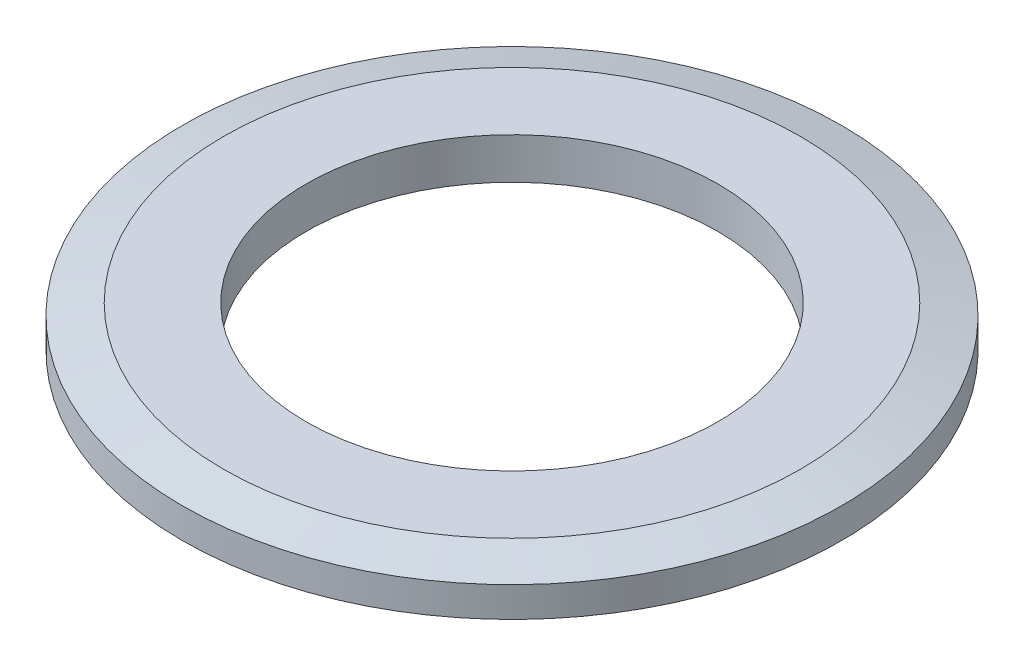
ISO-10303-21;
HEADER;
FILE_DESCRIPTION(('STEP AP214'),'2;1');
FILE_NAME('part.step','',(''),(''),'','','');
FILE_SCHEMA(('AUTOMOTIVE_DESIGN { 1 0 10303 214 1 1 1 1 }'));
ENDSEC;
DATA;
#1=APPLICATION_CONTEXT('core data for automotive mechanical design processes');
#2=APPLICATION_PROTOCOL_DEFINITION('international standard','automotive_design',2000,#1);
#3=PRODUCT_CONTEXT('',#1,'mechanical');
#4=PRODUCT('Part','Part','',(#3));
#5=PRODUCT_RELATED_PRODUCT_CATEGORY('part','',(#4));
#6=PRODUCT_DEFINITION_FORMATION('','',#4);
#7=PRODUCT_DEFINITION_CONTEXT('part definition',#1,'design');
#8=PRODUCT_DEFINITION('design','',#6,#7);
#9=PRODUCT_DEFINITION_SHAPE('','',#8);
#10=(LENGTH_UNIT() NAMED_UNIT(*) SI_UNIT(.MILLI.,.METRE.));
#11=(NAMED_UNIT(*) PLANE_ANGLE_UNIT() SI_UNIT($,.RADIAN.));
#12=(NAMED_UNIT(*) SI_UNIT($,.STERADIAN.) SOLID_ANGLE_UNIT());
#13=UNCERTAINTY_MEASURE_WITH_UNIT(LENGTH_MEASURE(1.E-05),#10,'distance_accuracy_value','');
#14=(GEOMETRIC_REPRESENTATION_CONTEXT(3) GLOBAL_UNCERTAINTY_ASSIGNED_CONTEXT((#13)) GLOBAL_UNIT_ASSIGNED_CONTEXT((#10,
#11,#12)) REPRESENTATION_CONTEXT('',''));
#15=CARTESIAN_POINT('',(0.,0.,0.));
#16=DIRECTION('',(0.,0.,1.));
#17=DIRECTION('',(1.,0.,0.));
#18=AXIS2_PLACEMENT_3D('',#15,#16,#17);
#19=CARTESIAN_POINT('',(0.,1.,0.));
#20=DIRECTION('',(0.,1.,0.));
#21=DIRECTION('',(0.,0.,1.));
#22=AXIS2_PLACEMENT_3D('',#19,#20,#21);
#23=PLANE('',#22);
#24=CARTESIAN_POINT('',(0.,1.,0.));
#25=DIRECTION('',(0.,1.,0.));
#26=DIRECTION('',(0.,0.,1.));
#27=AXIS2_PLACEMENT_3D('',#24,#25,#26);
#28=CIRCLE('',#27,6.99999999999999);
#29=CARTESIAN_POINT('',(0.,1.,6.99999999999999));
#30=VERTEX_POINT('',#29);
#31=EDGE_CURVE('E38',#30,#30,#28,.T.);
#32=ORIENTED_EDGE('',*,*,#31,.T.);
#33=EDGE_LOOP('',(#32));
#34=FACE_BOUND('',#33,.T.);
#35=CARTESIAN_POINT('',(0.,1.,0.));
#36=DIRECTION('',(0.,1.,0.));
#37=DIRECTION('',(0.,0.,1.));
#38=AXIS2_PLACEMENT_3D('',#35,#36,#37);
#39=CIRCLE('',#38,5.);
#40=CARTESIAN_POINT('',(0.,1.,5.));
#41=VERTEX_POINT('',#40);
#42=EDGE_CURVE('E46',#41,#41,#39,.T.);
#43=ORIENTED_EDGE('',*,*,#42,.F.);
#44=EDGE_LOOP('',(#43));
#45=FACE_BOUND('',#44,.T.);
#46=ADVANCED_FACE('F31',(#34,#45),#23,.T.);
#47=CARTESIAN_POINT('',(0.,0.,0.));
#48=DIRECTION('',(0.,1.,0.));
#49=DIRECTION('',(0.,0.,1.));
#50=AXIS2_PLACEMENT_3D('',#47,#48,#49);
#51=PLANE('',#50);
#52=CARTESIAN_POINT('',(0.,0.,0.));
#53=DIRECTION('',(0.,1.,0.));
#54=DIRECTION('',(0.,0.,1.));
#55=AXIS2_PLACEMENT_3D('',#52,#53,#54);
#56=CIRCLE('',#55,8.);
#57=CARTESIAN_POINT('',(0.,0.,8.));
#58=VERTEX_POINT('',#57);
#59=EDGE_CURVE('E42',#58,#58,#56,.T.);
#60=ORIENTED_EDGE('',*,*,#59,.F.);
#61=EDGE_LOOP('',(#60));
#62=FACE_BOUND('',#61,.T.);
#63=CARTESIAN_POINT('',(0.,0.,0.));
#64=DIRECTION('',(0.,1.,0.));
#65=DIRECTION('',(0.,0.,1.));
#66=AXIS2_PLACEMENT_3D('',#63,#64,#65);
#67=CIRCLE('',#66,5.);
#68=CARTESIAN_POINT('',(0.,0.,5.));
#69=VERTEX_POINT('',#68);
#70=EDGE_CURVE('E49',#69,#69,#67,.T.);
#71=ORIENTED_EDGE('',*,*,#70,.T.);
#72=EDGE_LOOP('',(#71));
#73=FACE_BOUND('',#72,.T.);
#74=ADVANCED_FACE('F59',(#62,#73),#51,.F.);
#75=CARTESIAN_POINT('',(0.,1.,0.));
#76=DIRECTION('',(0.,-1.,0.));
#77=DIRECTION('',(0.,0.,-1.));
#78=AXIS2_PLACEMENT_3D('',#75,#76,#77);
#79=CYLINDRICAL_SURFACE('',#78,8.);
#80=CARTESIAN_POINT('',(0.,0.732050807568877,0.));
#81=DIRECTION('',(0.,1.,0.));
#82=DIRECTION('',(0.,0.,1.));
#83=AXIS2_PLACEMENT_3D('',#80,#81,#82);
#84=CIRCLE('',#83,8.);
#85=CARTESIAN_POINT('',(0.,0.732050807568877,8.));
#86=VERTEX_POINT('',#85);
#87=EDGE_CURVE('E10',#86,#86,#84,.F.);
#88=ORIENTED_EDGE('',*,*,#87,.T.);
#89=EDGE_LOOP('',(#88));
#90=FACE_BOUND('',#89,.T.);
#91=ORIENTED_EDGE('',*,*,#59,.T.);
#92=EDGE_LOOP('',(#91));
#93=FACE_BOUND('',#92,.T.);
#94=ADVANCED_FACE('F64',(#90,#93),#79,.T.);
#95=CARTESIAN_POINT('',(0.,1.,0.));
#96=DIRECTION('',(0.,-1.,0.));
#97=DIRECTION('',(0.,0.,-1.));
#98=AXIS2_PLACEMENT_3D('',#95,#96,#97);
#99=CYLINDRICAL_SURFACE('',#98,5.);
#100=ORIENTED_EDGE('',*,*,#42,.T.);
#101=EDGE_LOOP('',(#100));
#102=FACE_BOUND('',#101,.T.);
#103=ORIENTED_EDGE('',*,*,#70,.F.);
#104=EDGE_LOOP('',(#103));
#105=FACE_BOUND('',#104,.T.);
#106=ADVANCED_FACE('F55',(#102,#105),#99,.F.);
#107=CARTESIAN_POINT('',(0.,1.,0.));
#108=DIRECTION('',(0.,-1.,0.));
#109=DIRECTION('',(0.,0.,-1.));
#110=AXIS2_PLACEMENT_3D('',#107,#108,#109);
#111=CONICAL_SURFACE('',#110,6.99999999999999,1.30899693899575);
#112=ORIENTED_EDGE('',*,*,#87,.F.);
#113=EDGE_LOOP('',(#112));
#114=FACE_BOUND('',#113,.T.);
#115=ORIENTED_EDGE('',*,*,#31,.F.);
#116=EDGE_LOOP('',(#115));
#117=FACE_BOUND('',#116,.T.);
#118=ADVANCED_FACE('F33',(#114,#117),#111,.T.);
#119=CLOSED_SHELL('',(#46,#74,#94,#106,#118));
#120=MANIFOLD_SOLID_BREP('B2',#119);
#121=ADVANCED_BREP_SHAPE_REPRESENTATION('',(#18,#120),#14);
#122=SHAPE_DEFINITION_REPRESENTATION(#9,#121);
ENDSEC;
END-ISO-10303-21;
